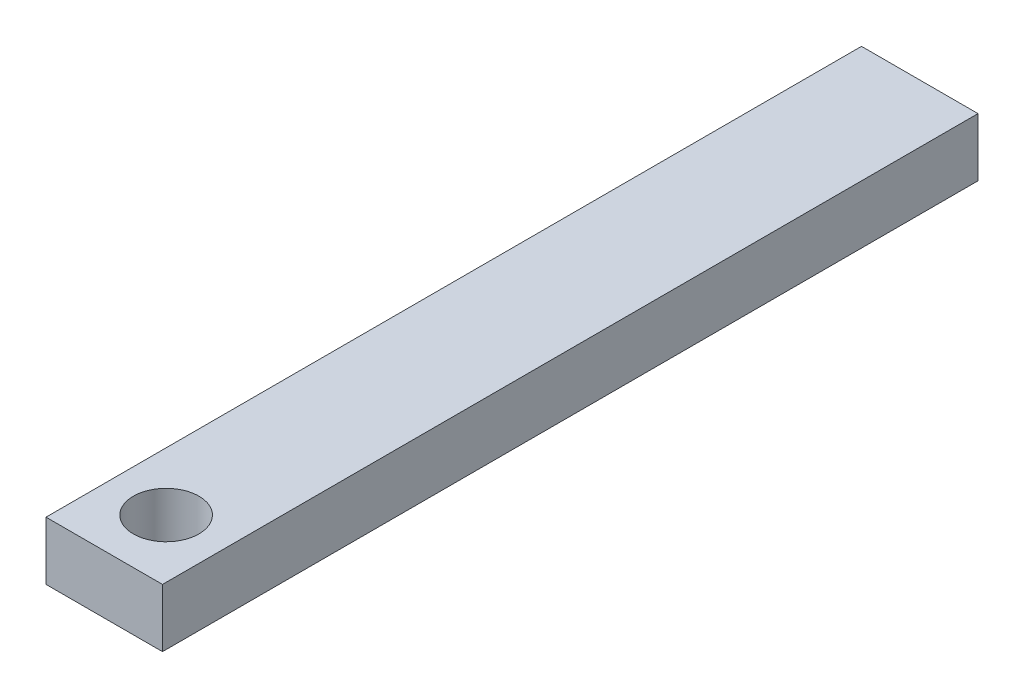
ISO-10303-21;
HEADER;
FILE_DESCRIPTION(('STEP AP214'),'2;1');
FILE_NAME('part.step','',(''),(''),'','','');
FILE_SCHEMA(('AUTOMOTIVE_DESIGN { 1 0 10303 214 1 1 1 1 }'));
ENDSEC;
DATA;
#1=APPLICATION_CONTEXT('core data for automotive mechanical design processes');
#2=APPLICATION_PROTOCOL_DEFINITION('international standard','automotive_design',2000,#1);
#3=PRODUCT_CONTEXT('',#1,'mechanical');
#4=PRODUCT('Part','Part','',(#3));
#5=PRODUCT_RELATED_PRODUCT_CATEGORY('part','',(#4));
#6=PRODUCT_DEFINITION_FORMATION('','',#4);
#7=PRODUCT_DEFINITION_CONTEXT('part definition',#1,'design');
#8=PRODUCT_DEFINITION('design','',#6,#7);
#9=PRODUCT_DEFINITION_SHAPE('','',#8);
#10=(LENGTH_UNIT() NAMED_UNIT(*) SI_UNIT(.MILLI.,.METRE.));
#11=(NAMED_UNIT(*) PLANE_ANGLE_UNIT() SI_UNIT($,.RADIAN.));
#12=(NAMED_UNIT(*) SI_UNIT($,.STERADIAN.) SOLID_ANGLE_UNIT());
#13=UNCERTAINTY_MEASURE_WITH_UNIT(LENGTH_MEASURE(1.E-05),#10,'distance_accuracy_value','');
#14=(GEOMETRIC_REPRESENTATION_CONTEXT(3) GLOBAL_UNCERTAINTY_ASSIGNED_CONTEXT((#13)) GLOBAL_UNIT_ASSIGNED_CONTEXT((#10,
#11,#12)) REPRESENTATION_CONTEXT('',''));
#15=CARTESIAN_POINT('',(0.,0.,0.));
#16=DIRECTION('',(0.,0.,1.));
#17=DIRECTION('',(1.,0.,0.));
#18=AXIS2_PLACEMENT_3D('',#15,#16,#17);
#19=CARTESIAN_POINT('',(0.,0.,355.6));
#20=DIRECTION('',(1.,0.,0.));
#21=DIRECTION('',(0.,0.,-1.));
#22=AXIS2_PLACEMENT_3D('',#19,#20,#21);
#23=PLANE('',#22);
#24=DIRECTION('',(0.,-1.,0.));
#25=VECTOR('',#24,1.);
#26=CARTESIAN_POINT('',(0.,0.,0.));
#27=LINE('',#26,#25);
#28=CARTESIAN_POINT('',(0.,25.4,0.));
#29=VERTEX_POINT('',#28);
#30=CARTESIAN_POINT('',(0.,0.,0.));
#31=VERTEX_POINT('',#30);
#32=EDGE_CURVE('E96',#29,#31,#27,.T.);
#33=ORIENTED_EDGE('',*,*,#32,.T.);
#34=DIRECTION('',(0.,0.,-1.));
#35=VECTOR('',#34,1.);
#36=CARTESIAN_POINT('',(0.,0.,355.6));
#37=LINE('',#36,#35);
#38=CARTESIAN_POINT('',(0.,0.,355.6));
#39=VERTEX_POINT('',#38);
#40=EDGE_CURVE('E11',#39,#31,#37,.T.);
#41=ORIENTED_EDGE('',*,*,#40,.F.);
#42=DIRECTION('',(0.,-1.,0.));
#43=VECTOR('',#42,1.);
#44=CARTESIAN_POINT('',(0.,0.,355.6));
#45=LINE('',#44,#43);
#46=CARTESIAN_POINT('',(0.,25.4,355.6));
#47=VERTEX_POINT('',#46);
#48=EDGE_CURVE('E84',#47,#39,#45,.T.);
#49=ORIENTED_EDGE('',*,*,#48,.F.);
#50=DIRECTION('',(0.,0.,-1.));
#51=VECTOR('',#50,1.);
#52=CARTESIAN_POINT('',(0.,25.4,355.6));
#53=LINE('',#52,#51);
#54=EDGE_CURVE('E92',#47,#29,#53,.T.);
#55=ORIENTED_EDGE('',*,*,#54,.T.);
#56=EDGE_LOOP('',(#33,#41,#49,#55));
#57=FACE_BOUND('',#56,.T.);
#58=ADVANCED_FACE('F33',(#57),#23,.F.);
#59=CARTESIAN_POINT('',(0.,0.,355.6));
#60=DIRECTION('',(0.,1.,0.));
#61=DIRECTION('',(0.,0.,1.));
#62=AXIS2_PLACEMENT_3D('',#59,#60,#61);
#63=PLANE('',#62);
#64=CARTESIAN_POINT('',(25.4,0.,328.6125));
#65=DIRECTION('',(0.,1.,0.));
#66=DIRECTION('',(0.,0.,1.));
#67=AXIS2_PLACEMENT_3D('',#64,#65,#66);
#68=CIRCLE('',#67,14.2875);
#69=CARTESIAN_POINT('',(25.4,0.,342.9));
#70=VERTEX_POINT('',#69);
#71=EDGE_CURVE('E99',#70,#70,#68,.T.);
#72=ORIENTED_EDGE('',*,*,#71,.T.);
#73=EDGE_LOOP('',(#72));
#74=FACE_BOUND('',#73,.T.);
#75=DIRECTION('',(1.,0.,0.));
#76=VECTOR('',#75,1.);
#77=CARTESIAN_POINT('',(0.,0.,0.));
#78=LINE('',#77,#76);
#79=CARTESIAN_POINT('',(50.8,0.,0.));
#80=VERTEX_POINT('',#79);
#81=EDGE_CURVE('E88',#31,#80,#78,.T.);
#82=ORIENTED_EDGE('',*,*,#81,.T.);
#83=DIRECTION('',(0.,0.,-1.));
#84=VECTOR('',#83,1.);
#85=CARTESIAN_POINT('',(50.8,0.,355.6));
#86=LINE('',#85,#84);
#87=CARTESIAN_POINT('',(50.8,0.,355.6));
#88=VERTEX_POINT('',#87);
#89=EDGE_CURVE('E41',#88,#80,#86,.T.);
#90=ORIENTED_EDGE('',*,*,#89,.F.);
#91=DIRECTION('',(1.,0.,0.));
#92=VECTOR('',#91,1.);
#93=CARTESIAN_POINT('',(0.,0.,355.6));
#94=LINE('',#93,#92);
#95=EDGE_CURVE('E79',#39,#88,#94,.T.);
#96=ORIENTED_EDGE('',*,*,#95,.F.);
#97=ORIENTED_EDGE('',*,*,#40,.T.);
#98=EDGE_LOOP('',(#82,#90,#96,#97));
#99=FACE_BOUND('',#98,.T.);
#100=ADVANCED_FACE('F87',(#74,#99),#63,.F.);
#101=CARTESIAN_POINT('',(50.8,0.,355.6));
#102=DIRECTION('',(-1.,0.,0.));
#103=DIRECTION('',(0.,0.,1.));
#104=AXIS2_PLACEMENT_3D('',#101,#102,#103);
#105=PLANE('',#104);
#106=DIRECTION('',(0.,1.,0.));
#107=VECTOR('',#106,1.);
#108=CARTESIAN_POINT('',(50.8,0.,0.));
#109=LINE('',#108,#107);
#110=CARTESIAN_POINT('',(50.8,25.4,0.));
#111=VERTEX_POINT('',#110);
#112=EDGE_CURVE('E66',#80,#111,#109,.T.);
#113=ORIENTED_EDGE('',*,*,#112,.T.);
#114=DIRECTION('',(0.,0.,-1.));
#115=VECTOR('',#114,1.);
#116=CARTESIAN_POINT('',(50.8,25.4,355.6));
#117=LINE('',#116,#115);
#118=CARTESIAN_POINT('',(50.8,25.4,355.6));
#119=VERTEX_POINT('',#118);
#120=EDGE_CURVE('E89',#119,#111,#117,.T.);
#121=ORIENTED_EDGE('',*,*,#120,.F.);
#122=DIRECTION('',(0.,1.,0.));
#123=VECTOR('',#122,1.);
#124=CARTESIAN_POINT('',(50.8,0.,355.6));
#125=LINE('',#124,#123);
#126=EDGE_CURVE('E82',#88,#119,#125,.T.);
#127=ORIENTED_EDGE('',*,*,#126,.F.);
#128=ORIENTED_EDGE('',*,*,#89,.T.);
#129=EDGE_LOOP('',(#113,#121,#127,#128));
#130=FACE_BOUND('',#129,.T.);
#131=ADVANCED_FACE('F90',(#130),#105,.F.);
#132=CARTESIAN_POINT('',(0.,25.4,355.6));
#133=DIRECTION('',(0.,-1.,0.));
#134=DIRECTION('',(0.,0.,-1.));
#135=AXIS2_PLACEMENT_3D('',#132,#133,#134);
#136=PLANE('',#135);
#137=CARTESIAN_POINT('',(25.4,25.4,328.6125));
#138=DIRECTION('',(0.,1.,0.));
#139=DIRECTION('',(0.,0.,1.));
#140=AXIS2_PLACEMENT_3D('',#137,#138,#139);
#141=CIRCLE('',#140,14.2875);
#142=CARTESIAN_POINT('',(25.4,25.4,342.9));
#143=VERTEX_POINT('',#142);
#144=EDGE_CURVE('E110',#143,#143,#141,.T.);
#145=ORIENTED_EDGE('',*,*,#144,.F.);
#146=EDGE_LOOP('',(#145));
#147=FACE_BOUND('',#146,.T.);
#148=DIRECTION('',(-1.,0.,0.));
#149=VECTOR('',#148,1.);
#150=CARTESIAN_POINT('',(0.,25.4,0.));
#151=LINE('',#150,#149);
#152=EDGE_CURVE('E72',#111,#29,#151,.T.);
#153=ORIENTED_EDGE('',*,*,#152,.T.);
#154=ORIENTED_EDGE('',*,*,#54,.F.);
#155=DIRECTION('',(-1.,0.,0.));
#156=VECTOR('',#155,1.);
#157=CARTESIAN_POINT('',(0.,25.4,355.6));
#158=LINE('',#157,#156);
#159=EDGE_CURVE('E49',#119,#47,#158,.T.);
#160=ORIENTED_EDGE('',*,*,#159,.F.);
#161=ORIENTED_EDGE('',*,*,#120,.T.);
#162=EDGE_LOOP('',(#153,#154,#160,#161));
#163=FACE_BOUND('',#162,.T.);
#164=ADVANCED_FACE('F104',(#147,#163),#136,.F.);
#165=CARTESIAN_POINT('',(0.,0.,355.6));
#166=DIRECTION('',(0.,0.,-1.));
#167=DIRECTION('',(-1.,0.,0.));
#168=AXIS2_PLACEMENT_3D('',#165,#166,#167);
#169=PLANE('',#168);
#170=ORIENTED_EDGE('',*,*,#48,.T.);
#171=ORIENTED_EDGE('',*,*,#95,.T.);
#172=ORIENTED_EDGE('',*,*,#126,.T.);
#173=ORIENTED_EDGE('',*,*,#159,.T.);
#174=EDGE_LOOP('',(#170,#171,#172,#173));
#175=FACE_BOUND('',#174,.T.);
#176=ADVANCED_FACE('F80',(#175),#169,.F.);
#177=CARTESIAN_POINT('',(0.,0.,0.));
#178=DIRECTION('',(0.,0.,-1.));
#179=DIRECTION('',(-1.,0.,0.));
#180=AXIS2_PLACEMENT_3D('',#177,#178,#179);
#181=PLANE('',#180);
#182=ORIENTED_EDGE('',*,*,#32,.F.);
#183=ORIENTED_EDGE('',*,*,#152,.F.);
#184=ORIENTED_EDGE('',*,*,#112,.F.);
#185=ORIENTED_EDGE('',*,*,#81,.F.);
#186=EDGE_LOOP('',(#182,#183,#184,#185));
#187=FACE_BOUND('',#186,.T.);
#188=ADVANCED_FACE('F107',(#187),#181,.T.);
#189=CARTESIAN_POINT('',(25.4,0.,328.6125));
#190=DIRECTION('',(0.,1.,0.));
#191=DIRECTION('',(0.,0.,1.));
#192=AXIS2_PLACEMENT_3D('',#189,#190,#191);
#193=CYLINDRICAL_SURFACE('',#192,14.2875);
#194=ORIENTED_EDGE('',*,*,#71,.F.);
#195=EDGE_LOOP('',(#194));
#196=FACE_BOUND('',#195,.T.);
#197=ORIENTED_EDGE('',*,*,#144,.T.);
#198=EDGE_LOOP('',(#197));
#199=FACE_BOUND('',#198,.T.);
#200=ADVANCED_FACE('F117',(#196,#199),#193,.F.);
#201=CLOSED_SHELL('',(#58,#100,#131,#164,#176,#188,#200));
#202=MANIFOLD_SOLID_BREP('B2',#201);
#203=ADVANCED_BREP_SHAPE_REPRESENTATION('',(#18,#202),#14);
#204=SHAPE_DEFINITION_REPRESENTATION(#9,#203);
ENDSEC;
END-ISO-10303-21;
